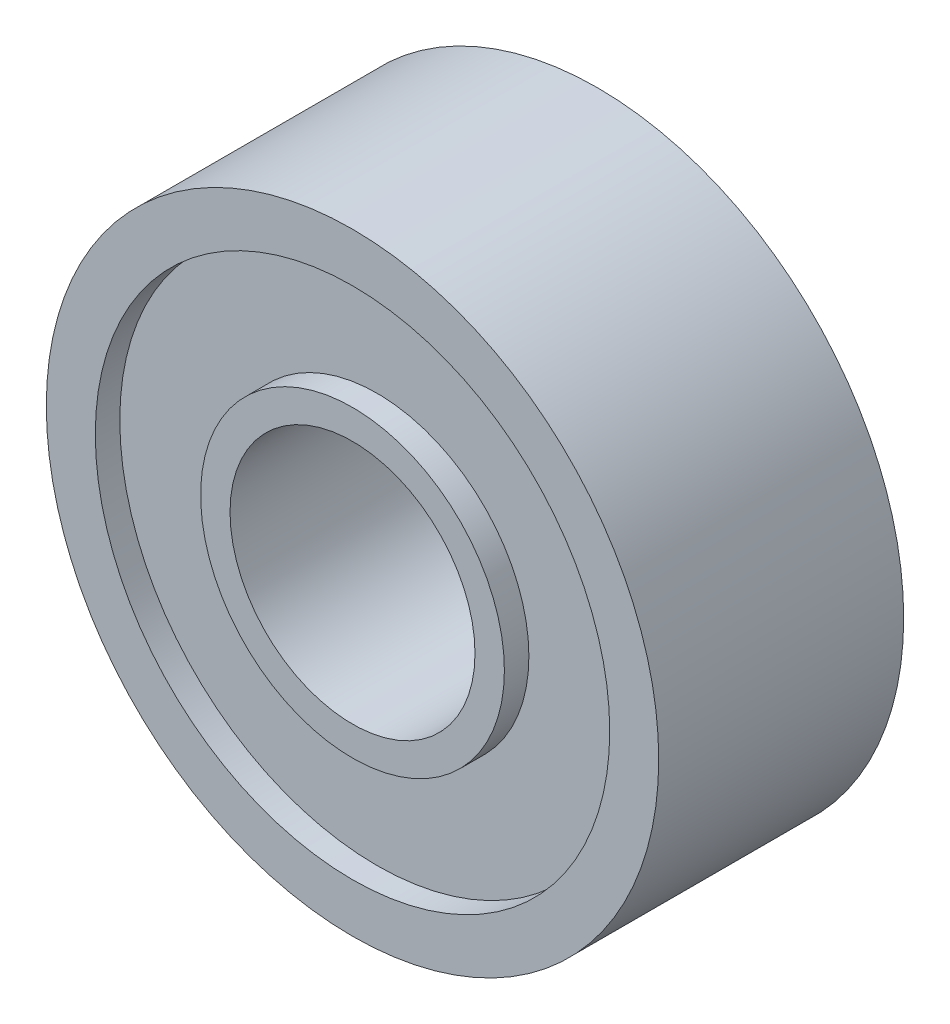
ISO-10303-21;
HEADER;
FILE_DESCRIPTION(('STEP AP214'),'2;1');
FILE_NAME('part.step','',(''),(''),'','','');
FILE_SCHEMA(('AUTOMOTIVE_DESIGN { 1 0 10303 214 1 1 1 1 }'));
ENDSEC;
DATA;
#1=APPLICATION_CONTEXT('core data for automotive mechanical design processes');
#2=APPLICATION_PROTOCOL_DEFINITION('international standard','automotive_design',2000,#1);
#3=PRODUCT_CONTEXT('',#1,'mechanical');
#4=PRODUCT('Part','Part','',(#3));
#5=PRODUCT_RELATED_PRODUCT_CATEGORY('part','',(#4));
#6=PRODUCT_DEFINITION_FORMATION('','',#4);
#7=PRODUCT_DEFINITION_CONTEXT('part definition',#1,'design');
#8=PRODUCT_DEFINITION('design','',#6,#7);
#9=PRODUCT_DEFINITION_SHAPE('','',#8);
#10=(LENGTH_UNIT() NAMED_UNIT(*) SI_UNIT(.MILLI.,.METRE.));
#11=(NAMED_UNIT(*) PLANE_ANGLE_UNIT() SI_UNIT($,.RADIAN.));
#12=(NAMED_UNIT(*) SI_UNIT($,.STERADIAN.) SOLID_ANGLE_UNIT());
#13=UNCERTAINTY_MEASURE_WITH_UNIT(LENGTH_MEASURE(1.E-05),#10,'distance_accuracy_value','');
#14=(GEOMETRIC_REPRESENTATION_CONTEXT(3) GLOBAL_UNCERTAINTY_ASSIGNED_CONTEXT((#13)) GLOBAL_UNIT_ASSIGNED_CONTEXT((#10,
#11,#12)) REPRESENTATION_CONTEXT('',''));
#15=CARTESIAN_POINT('',(0.,0.,0.));
#16=DIRECTION('',(0.,0.,1.));
#17=DIRECTION('',(1.,0.,0.));
#18=AXIS2_PLACEMENT_3D('',#15,#16,#17);
#19=CARTESIAN_POINT('',(0.,0.,-5.));
#20=DIRECTION('',(0.,0.,1.));
#21=DIRECTION('',(1.,0.,0.));
#22=AXIS2_PLACEMENT_3D('',#19,#20,#21);
#23=PLANE('',#22);
#24=CARTESIAN_POINT('',(0.,0.,-5.));
#25=DIRECTION('',(0.,0.,1.));
#26=DIRECTION('',(1.,0.,0.));
#27=AXIS2_PLACEMENT_3D('',#24,#25,#26);
#28=CIRCLE('',#27,5.);
#29=CARTESIAN_POINT('',(5.,0.,-5.));
#30=VERTEX_POINT('',#29);
#31=EDGE_CURVE('E52',#30,#30,#28,.T.);
#32=ORIENTED_EDGE('',*,*,#31,.T.);
#33=EDGE_LOOP('',(#32));
#34=FACE_BOUND('',#33,.T.);
#35=CARTESIAN_POINT('',(0.,0.,-5.));
#36=DIRECTION('',(0.,0.,1.));
#37=DIRECTION('',(1.,0.,0.));
#38=AXIS2_PLACEMENT_3D('',#35,#36,#37);
#39=CIRCLE('',#38,6.2);
#40=CARTESIAN_POINT('',(6.2,0.,-5.));
#41=VERTEX_POINT('',#40);
#42=EDGE_CURVE('E84',#41,#41,#39,.T.);
#43=ORIENTED_EDGE('',*,*,#42,.F.);
#44=EDGE_LOOP('',(#43));
#45=FACE_BOUND('',#44,.T.);
#46=ADVANCED_FACE('F37',(#34,#45),#23,.F.);
#47=CARTESIAN_POINT('',(0.,0.,5.));
#48=DIRECTION('',(0.,0.,1.));
#49=DIRECTION('',(1.,0.,0.));
#50=AXIS2_PLACEMENT_3D('',#47,#48,#49);
#51=PLANE('',#50);
#52=CARTESIAN_POINT('',(0.,0.,5.));
#53=DIRECTION('',(0.,0.,1.));
#54=DIRECTION('',(1.,0.,0.));
#55=AXIS2_PLACEMENT_3D('',#52,#53,#54);
#56=CIRCLE('',#55,5.);
#57=CARTESIAN_POINT('',(5.,0.,5.));
#58=VERTEX_POINT('',#57);
#59=EDGE_CURVE('E50',#58,#58,#56,.T.);
#60=ORIENTED_EDGE('',*,*,#59,.F.);
#61=EDGE_LOOP('',(#60));
#62=FACE_BOUND('',#61,.T.);
#63=CARTESIAN_POINT('',(0.,0.,5.));
#64=DIRECTION('',(0.,0.,1.));
#65=DIRECTION('',(1.,0.,0.));
#66=AXIS2_PLACEMENT_3D('',#63,#64,#65);
#67=CIRCLE('',#66,6.2);
#68=CARTESIAN_POINT('',(6.2,0.,5.));
#69=VERTEX_POINT('',#68);
#70=EDGE_CURVE('E68',#69,#69,#67,.T.);
#71=ORIENTED_EDGE('',*,*,#70,.T.);
#72=EDGE_LOOP('',(#71));
#73=FACE_BOUND('',#72,.T.);
#74=ADVANCED_FACE('F102',(#62,#73),#51,.T.);
#75=CARTESIAN_POINT('',(0.,0.,5.));
#76=DIRECTION('',(0.,0.,1.));
#77=DIRECTION('',(1.,0.,0.));
#78=AXIS2_PLACEMENT_3D('',#75,#76,#77);
#79=CIRCLE('',#78,10.5);
#80=CARTESIAN_POINT('',(10.5,0.,5.));
#81=VERTEX_POINT('',#80);
#82=EDGE_CURVE('E60',#81,#81,#79,.T.);
#83=ORIENTED_EDGE('',*,*,#82,.F.);
#84=EDGE_LOOP('',(#83));
#85=FACE_BOUND('',#84,.T.);
#86=CARTESIAN_POINT('',(0.,0.,5.));
#87=DIRECTION('',(0.,0.,1.));
#88=DIRECTION('',(1.,0.,0.));
#89=AXIS2_PLACEMENT_3D('',#86,#87,#88);
#90=CIRCLE('',#89,12.5);
#91=CARTESIAN_POINT('',(12.5,0.,5.));
#92=VERTEX_POINT('',#91);
#93=EDGE_CURVE('E10',#92,#92,#90,.T.);
#94=ORIENTED_EDGE('',*,*,#93,.T.);
#95=EDGE_LOOP('',(#94));
#96=FACE_BOUND('',#95,.T.);
#97=ADVANCED_FACE('F108',(#85,#96),#51,.T.);
#98=CARTESIAN_POINT('',(0.,0.,-5.));
#99=DIRECTION('',(0.,0.,1.));
#100=DIRECTION('',(1.,0.,0.));
#101=AXIS2_PLACEMENT_3D('',#98,#99,#100);
#102=CIRCLE('',#101,10.5);
#103=CARTESIAN_POINT('',(10.5,0.,-5.));
#104=VERTEX_POINT('',#103);
#105=EDGE_CURVE('E76',#104,#104,#102,.T.);
#106=ORIENTED_EDGE('',*,*,#105,.T.);
#107=EDGE_LOOP('',(#106));
#108=FACE_BOUND('',#107,.T.);
#109=CARTESIAN_POINT('',(0.,0.,-5.));
#110=DIRECTION('',(0.,0.,1.));
#111=DIRECTION('',(1.,0.,0.));
#112=AXIS2_PLACEMENT_3D('',#109,#110,#111);
#113=CIRCLE('',#112,12.5);
#114=CARTESIAN_POINT('',(12.5,0.,-5.));
#115=VERTEX_POINT('',#114);
#116=EDGE_CURVE('E41',#115,#115,#113,.T.);
#117=ORIENTED_EDGE('',*,*,#116,.F.);
#118=EDGE_LOOP('',(#117));
#119=FACE_BOUND('',#118,.T.);
#120=ADVANCED_FACE('F104',(#108,#119),#23,.F.);
#121=CARTESIAN_POINT('',(0.,0.,5.));
#122=DIRECTION('',(0.,0.,-1.));
#123=DIRECTION('',(-1.,0.,0.));
#124=AXIS2_PLACEMENT_3D('',#121,#122,#123);
#125=CYLINDRICAL_SURFACE('',#124,12.5);
#126=ORIENTED_EDGE('',*,*,#93,.F.);
#127=EDGE_LOOP('',(#126));
#128=FACE_BOUND('',#127,.T.);
#129=ORIENTED_EDGE('',*,*,#116,.T.);
#130=EDGE_LOOP('',(#129));
#131=FACE_BOUND('',#130,.T.);
#132=ADVANCED_FACE('F39',(#128,#131),#125,.T.);
#133=CARTESIAN_POINT('',(0.,0.,5.));
#134=DIRECTION('',(0.,0.,-1.));
#135=DIRECTION('',(-1.,0.,0.));
#136=AXIS2_PLACEMENT_3D('',#133,#134,#135);
#137=CYLINDRICAL_SURFACE('',#136,5.);
#138=ORIENTED_EDGE('',*,*,#59,.T.);
#139=EDGE_LOOP('',(#138));
#140=FACE_BOUND('',#139,.T.);
#141=ORIENTED_EDGE('',*,*,#31,.F.);
#142=EDGE_LOOP('',(#141));
#143=FACE_BOUND('',#142,.T.);
#144=ADVANCED_FACE('F117',(#140,#143),#137,.F.);
#145=CARTESIAN_POINT('',(0.,0.,4.));
#146=DIRECTION('',(0.,0.,1.));
#147=DIRECTION('',(1.,0.,0.));
#148=AXIS2_PLACEMENT_3D('',#145,#146,#147);
#149=CYLINDRICAL_SURFACE('',#148,10.5);
#150=CARTESIAN_POINT('',(0.,0.,4.));
#151=DIRECTION('',(0.,0.,1.));
#152=DIRECTION('',(1.,0.,0.));
#153=AXIS2_PLACEMENT_3D('',#150,#151,#152);
#154=CIRCLE('',#153,10.5);
#155=CARTESIAN_POINT('',(10.5,0.,4.));
#156=VERTEX_POINT('',#155);
#157=EDGE_CURVE('E56',#156,#156,#154,.T.);
#158=ORIENTED_EDGE('',*,*,#157,.F.);
#159=EDGE_LOOP('',(#158));
#160=FACE_BOUND('',#159,.T.);
#161=ORIENTED_EDGE('',*,*,#82,.T.);
#162=EDGE_LOOP('',(#161));
#163=FACE_BOUND('',#162,.T.);
#164=ADVANCED_FACE('F141',(#160,#163),#149,.F.);
#165=CARTESIAN_POINT('',(0.,0.,4.));
#166=DIRECTION('',(0.,0.,1.));
#167=DIRECTION('',(1.,0.,0.));
#168=AXIS2_PLACEMENT_3D('',#165,#166,#167);
#169=PLANE('',#168);
#170=CARTESIAN_POINT('',(0.,0.,4.));
#171=DIRECTION('',(0.,0.,1.));
#172=DIRECTION('',(1.,0.,0.));
#173=AXIS2_PLACEMENT_3D('',#170,#171,#172);
#174=CIRCLE('',#173,6.2);
#175=CARTESIAN_POINT('',(6.2,0.,4.));
#176=VERTEX_POINT('',#175);
#177=EDGE_CURVE('E64',#176,#176,#174,.T.);
#178=ORIENTED_EDGE('',*,*,#177,.F.);
#179=EDGE_LOOP('',(#178));
#180=FACE_BOUND('',#179,.T.);
#181=ORIENTED_EDGE('',*,*,#157,.T.);
#182=EDGE_LOOP('',(#181));
#183=FACE_BOUND('',#182,.T.);
#184=ADVANCED_FACE('F137',(#180,#183),#169,.T.);
#185=CARTESIAN_POINT('',(0.,0.,4.));
#186=DIRECTION('',(0.,0.,1.));
#187=DIRECTION('',(1.,0.,0.));
#188=AXIS2_PLACEMENT_3D('',#185,#186,#187);
#189=CYLINDRICAL_SURFACE('',#188,6.2);
#190=ORIENTED_EDGE('',*,*,#177,.T.);
#191=EDGE_LOOP('',(#190));
#192=FACE_BOUND('',#191,.T.);
#193=ORIENTED_EDGE('',*,*,#70,.F.);
#194=EDGE_LOOP('',(#193));
#195=FACE_BOUND('',#194,.T.);
#196=ADVANCED_FACE('F131',(#192,#195),#189,.T.);
#197=CARTESIAN_POINT('',(0.,0.,-4.));
#198=DIRECTION('',(0.,0.,-1.));
#199=DIRECTION('',(1.,0.,0.));
#200=AXIS2_PLACEMENT_3D('',#197,#198,#199);
#201=PLANE('',#200);
#202=CARTESIAN_POINT('',(0.,0.,-4.));
#203=DIRECTION('',(0.,0.,1.));
#204=DIRECTION('',(1.,0.,0.));
#205=AXIS2_PLACEMENT_3D('',#202,#203,#204);
#206=CIRCLE('',#205,10.5);
#207=CARTESIAN_POINT('',(10.5,0.,-4.));
#208=VERTEX_POINT('',#207);
#209=EDGE_CURVE('E72',#208,#208,#206,.T.);
#210=ORIENTED_EDGE('',*,*,#209,.F.);
#211=EDGE_LOOP('',(#210));
#212=FACE_BOUND('',#211,.T.);
#213=CARTESIAN_POINT('',(0.,0.,-4.));
#214=DIRECTION('',(0.,0.,1.));
#215=DIRECTION('',(1.,0.,0.));
#216=AXIS2_PLACEMENT_3D('',#213,#214,#215);
#217=CIRCLE('',#216,6.2);
#218=CARTESIAN_POINT('',(6.2,0.,-4.));
#219=VERTEX_POINT('',#218);
#220=EDGE_CURVE('E80',#219,#219,#217,.T.);
#221=ORIENTED_EDGE('',*,*,#220,.T.);
#222=EDGE_LOOP('',(#221));
#223=FACE_BOUND('',#222,.T.);
#224=ADVANCED_FACE('F92',(#212,#223),#201,.T.);
#225=CARTESIAN_POINT('',(0.,0.,-4.));
#226=DIRECTION('',(0.,0.,-1.));
#227=DIRECTION('',(-1.,0.,0.));
#228=AXIS2_PLACEMENT_3D('',#225,#226,#227);
#229=CYLINDRICAL_SURFACE('',#228,10.5);
#230=ORIENTED_EDGE('',*,*,#209,.T.);
#231=EDGE_LOOP('',(#230));
#232=FACE_BOUND('',#231,.T.);
#233=ORIENTED_EDGE('',*,*,#105,.F.);
#234=EDGE_LOOP('',(#233));
#235=FACE_BOUND('',#234,.T.);
#236=ADVANCED_FACE('F97',(#232,#235),#229,.F.);
#237=CARTESIAN_POINT('',(0.,0.,-4.));
#238=DIRECTION('',(0.,0.,-1.));
#239=DIRECTION('',(-1.,0.,0.));
#240=AXIS2_PLACEMENT_3D('',#237,#238,#239);
#241=CYLINDRICAL_SURFACE('',#240,6.2);
#242=ORIENTED_EDGE('',*,*,#220,.F.);
#243=EDGE_LOOP('',(#242));
#244=FACE_BOUND('',#243,.T.);
#245=ORIENTED_EDGE('',*,*,#42,.T.);
#246=EDGE_LOOP('',(#245));
#247=FACE_BOUND('',#246,.T.);
#248=ADVANCED_FACE('F94',(#244,#247),#241,.T.);
#249=CLOSED_SHELL('',(#46,#74,#97,#120,#132,#144,#164,#184,#196,#224,#236,#248));
#250=MANIFOLD_SOLID_BREP('B2',#249);
#251=ADVANCED_BREP_SHAPE_REPRESENTATION('',(#18,#250),#14);
#252=SHAPE_DEFINITION_REPRESENTATION(#9,#251);
ENDSEC;
END-ISO-10303-21;
